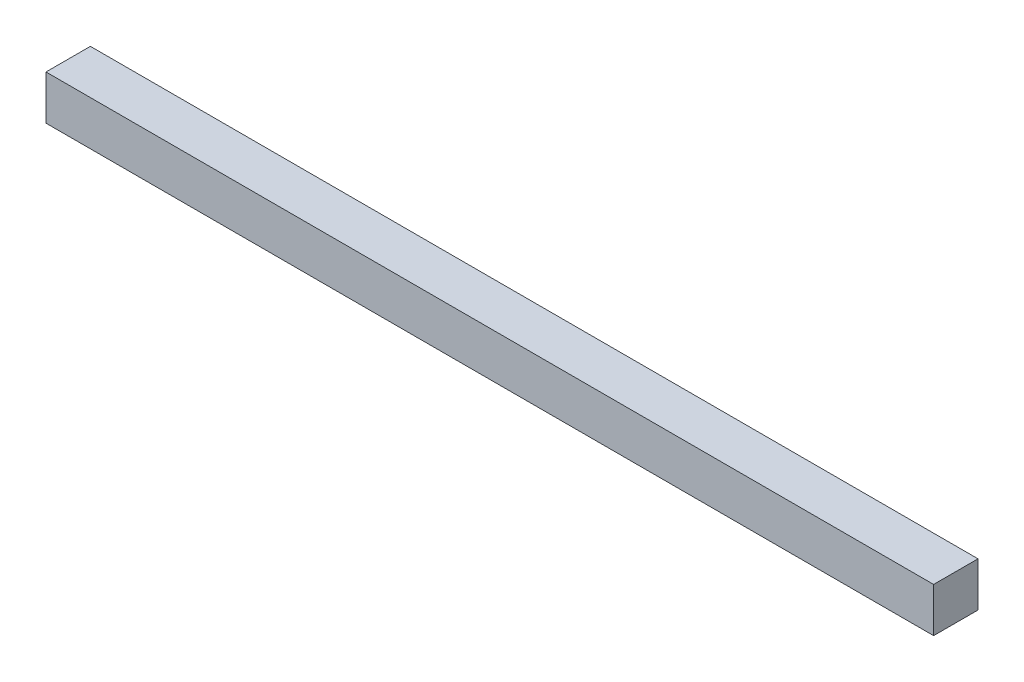
ISO-10303-21;
HEADER;
FILE_DESCRIPTION(('STEP AP214'),'2;1');
FILE_NAME('part.step','',(''),(''),'','','');
FILE_SCHEMA(('AUTOMOTIVE_DESIGN { 1 0 10303 214 1 1 1 1 }'));
ENDSEC;
DATA;
#1=APPLICATION_CONTEXT('core data for automotive mechanical design processes');
#2=APPLICATION_PROTOCOL_DEFINITION('international standard','automotive_design',2000,#1);
#3=PRODUCT_CONTEXT('',#1,'mechanical');
#4=PRODUCT('Part','Part','',(#3));
#5=PRODUCT_RELATED_PRODUCT_CATEGORY('part','',(#4));
#6=PRODUCT_DEFINITION_FORMATION('','',#4);
#7=PRODUCT_DEFINITION_CONTEXT('part definition',#1,'design');
#8=PRODUCT_DEFINITION('design','',#6,#7);
#9=PRODUCT_DEFINITION_SHAPE('','',#8);
#10=(LENGTH_UNIT() NAMED_UNIT(*) SI_UNIT(.MILLI.,.METRE.));
#11=(NAMED_UNIT(*) PLANE_ANGLE_UNIT() SI_UNIT($,.RADIAN.));
#12=(NAMED_UNIT(*) SI_UNIT($,.STERADIAN.) SOLID_ANGLE_UNIT());
#13=UNCERTAINTY_MEASURE_WITH_UNIT(LENGTH_MEASURE(1.E-05),#10,'distance_accuracy_value','');
#14=(GEOMETRIC_REPRESENTATION_CONTEXT(3) GLOBAL_UNCERTAINTY_ASSIGNED_CONTEXT((#13)) GLOBAL_UNIT_ASSIGNED_CONTEXT((#10,
#11,#12)) REPRESENTATION_CONTEXT('',''));
#15=CARTESIAN_POINT('',(0.,0.,0.));
#16=DIRECTION('',(0.,0.,1.));
#17=DIRECTION('',(1.,0.,0.));
#18=AXIS2_PLACEMENT_3D('',#15,#16,#17);
#19=CARTESIAN_POINT('',(0.,10.,0.));
#20=DIRECTION('',(1.,0.,0.));
#21=DIRECTION('',(0.,0.,-1.));
#22=AXIS2_PLACEMENT_3D('',#19,#20,#21);
#23=PLANE('',#22);
#24=DIRECTION('',(0.,0.,1.));
#25=VECTOR('',#24,1.);
#26=CARTESIAN_POINT('',(0.,0.,0.));
#27=LINE('',#26,#25);
#28=CARTESIAN_POINT('',(0.,0.,-10.));
#29=VERTEX_POINT('',#28);
#30=CARTESIAN_POINT('',(0.,0.,0.));
#31=VERTEX_POINT('',#30);
#32=EDGE_CURVE('E94',#29,#31,#27,.T.);
#33=ORIENTED_EDGE('',*,*,#32,.T.);
#34=DIRECTION('',(0.,-1.,0.));
#35=VECTOR('',#34,1.);
#36=CARTESIAN_POINT('',(0.,10.,0.));
#37=LINE('',#36,#35);
#38=CARTESIAN_POINT('',(0.,10.,0.));
#39=VERTEX_POINT('',#38);
#40=EDGE_CURVE('E11',#39,#31,#37,.T.);
#41=ORIENTED_EDGE('',*,*,#40,.F.);
#42=DIRECTION('',(0.,0.,1.));
#43=VECTOR('',#42,1.);
#44=CARTESIAN_POINT('',(0.,10.,0.));
#45=LINE('',#44,#43);
#46=CARTESIAN_POINT('',(0.,10.,-10.));
#47=VERTEX_POINT('',#46);
#48=EDGE_CURVE('E82',#47,#39,#45,.T.);
#49=ORIENTED_EDGE('',*,*,#48,.F.);
#50=DIRECTION('',(0.,-1.,0.));
#51=VECTOR('',#50,1.);
#52=CARTESIAN_POINT('',(0.,10.,-10.));
#53=LINE('',#52,#51);
#54=EDGE_CURVE('E90',#47,#29,#53,.T.);
#55=ORIENTED_EDGE('',*,*,#54,.T.);
#56=EDGE_LOOP('',(#33,#41,#49,#55));
#57=FACE_BOUND('',#56,.T.);
#58=ADVANCED_FACE('F31',(#57),#23,.F.);
#59=CARTESIAN_POINT('',(0.,10.,0.));
#60=DIRECTION('',(0.,0.,-1.));
#61=DIRECTION('',(-1.,0.,0.));
#62=AXIS2_PLACEMENT_3D('',#59,#60,#61);
#63=PLANE('',#62);
#64=DIRECTION('',(1.,0.,0.));
#65=VECTOR('',#64,1.);
#66=CARTESIAN_POINT('',(0.,0.,0.));
#67=LINE('',#66,#65);
#68=CARTESIAN_POINT('',(200.,0.,0.));
#69=VERTEX_POINT('',#68);
#70=EDGE_CURVE('E86',#31,#69,#67,.T.);
#71=ORIENTED_EDGE('',*,*,#70,.T.);
#72=DIRECTION('',(0.,-1.,0.));
#73=VECTOR('',#72,1.);
#74=CARTESIAN_POINT('',(200.,10.,0.));
#75=LINE('',#74,#73);
#76=CARTESIAN_POINT('',(200.,10.,0.));
#77=VERTEX_POINT('',#76);
#78=EDGE_CURVE('E39',#77,#69,#75,.T.);
#79=ORIENTED_EDGE('',*,*,#78,.F.);
#80=DIRECTION('',(1.,0.,0.));
#81=VECTOR('',#80,1.);
#82=CARTESIAN_POINT('',(0.,10.,0.));
#83=LINE('',#82,#81);
#84=EDGE_CURVE('E77',#39,#77,#83,.T.);
#85=ORIENTED_EDGE('',*,*,#84,.F.);
#86=ORIENTED_EDGE('',*,*,#40,.T.);
#87=EDGE_LOOP('',(#71,#79,#85,#86));
#88=FACE_BOUND('',#87,.T.);
#89=ADVANCED_FACE('F85',(#88),#63,.F.);
#90=CARTESIAN_POINT('',(200.,10.,0.));
#91=DIRECTION('',(-1.,0.,0.));
#92=DIRECTION('',(0.,0.,1.));
#93=AXIS2_PLACEMENT_3D('',#90,#91,#92);
#94=PLANE('',#93);
#95=DIRECTION('',(0.,0.,-1.));
#96=VECTOR('',#95,1.);
#97=CARTESIAN_POINT('',(200.,0.,0.));
#98=LINE('',#97,#96);
#99=CARTESIAN_POINT('',(200.,0.,-10.));
#100=VERTEX_POINT('',#99);
#101=EDGE_CURVE('E64',#69,#100,#98,.T.);
#102=ORIENTED_EDGE('',*,*,#101,.T.);
#103=DIRECTION('',(0.,-1.,0.));
#104=VECTOR('',#103,1.);
#105=CARTESIAN_POINT('',(200.,10.,-10.));
#106=LINE('',#105,#104);
#107=CARTESIAN_POINT('',(200.,10.,-10.));
#108=VERTEX_POINT('',#107);
#109=EDGE_CURVE('E87',#108,#100,#106,.T.);
#110=ORIENTED_EDGE('',*,*,#109,.F.);
#111=DIRECTION('',(0.,0.,-1.));
#112=VECTOR('',#111,1.);
#113=CARTESIAN_POINT('',(200.,10.,0.));
#114=LINE('',#113,#112);
#115=EDGE_CURVE('E80',#77,#108,#114,.T.);
#116=ORIENTED_EDGE('',*,*,#115,.F.);
#117=ORIENTED_EDGE('',*,*,#78,.T.);
#118=EDGE_LOOP('',(#102,#110,#116,#117));
#119=FACE_BOUND('',#118,.T.);
#120=ADVANCED_FACE('F88',(#119),#94,.F.);
#121=CARTESIAN_POINT('',(0.,10.,-10.));
#122=DIRECTION('',(0.,0.,1.));
#123=DIRECTION('',(1.,0.,0.));
#124=AXIS2_PLACEMENT_3D('',#121,#122,#123);
#125=PLANE('',#124);
#126=DIRECTION('',(-1.,0.,0.));
#127=VECTOR('',#126,1.);
#128=CARTESIAN_POINT('',(0.,0.,-10.));
#129=LINE('',#128,#127);
#130=EDGE_CURVE('E70',#100,#29,#129,.T.);
#131=ORIENTED_EDGE('',*,*,#130,.T.);
#132=ORIENTED_EDGE('',*,*,#54,.F.);
#133=DIRECTION('',(-1.,0.,0.));
#134=VECTOR('',#133,1.);
#135=CARTESIAN_POINT('',(0.,10.,-10.));
#136=LINE('',#135,#134);
#137=EDGE_CURVE('E47',#108,#47,#136,.T.);
#138=ORIENTED_EDGE('',*,*,#137,.F.);
#139=ORIENTED_EDGE('',*,*,#109,.T.);
#140=EDGE_LOOP('',(#131,#132,#138,#139));
#141=FACE_BOUND('',#140,.T.);
#142=ADVANCED_FACE('F101',(#141),#125,.F.);
#143=CARTESIAN_POINT('',(0.,10.,-10.));
#144=DIRECTION('',(0.,-1.,0.));
#145=DIRECTION('',(0.,0.,-1.));
#146=AXIS2_PLACEMENT_3D('',#143,#144,#145);
#147=PLANE('',#146);
#148=ORIENTED_EDGE('',*,*,#48,.T.);
#149=ORIENTED_EDGE('',*,*,#84,.T.);
#150=ORIENTED_EDGE('',*,*,#115,.T.);
#151=ORIENTED_EDGE('',*,*,#137,.T.);
#152=EDGE_LOOP('',(#148,#149,#150,#151));
#153=FACE_BOUND('',#152,.T.);
#154=ADVANCED_FACE('F78',(#153),#147,.F.);
#155=CARTESIAN_POINT('',(0.,0.,-10.));
#156=DIRECTION('',(0.,-1.,0.));
#157=DIRECTION('',(0.,0.,-1.));
#158=AXIS2_PLACEMENT_3D('',#155,#156,#157);
#159=PLANE('',#158);
#160=ORIENTED_EDGE('',*,*,#32,.F.);
#161=ORIENTED_EDGE('',*,*,#130,.F.);
#162=ORIENTED_EDGE('',*,*,#101,.F.);
#163=ORIENTED_EDGE('',*,*,#70,.F.);
#164=EDGE_LOOP('',(#160,#161,#162,#163));
#165=FACE_BOUND('',#164,.T.);
#166=ADVANCED_FACE('F104',(#165),#159,.T.);
#167=CLOSED_SHELL('',(#58,#89,#120,#142,#154,#166));
#168=MANIFOLD_SOLID_BREP('B2',#167);
#169=ADVANCED_BREP_SHAPE_REPRESENTATION('',(#18,#168),#14);
#170=SHAPE_DEFINITION_REPRESENTATION(#9,#169);
ENDSEC;
END-ISO-10303-21;
